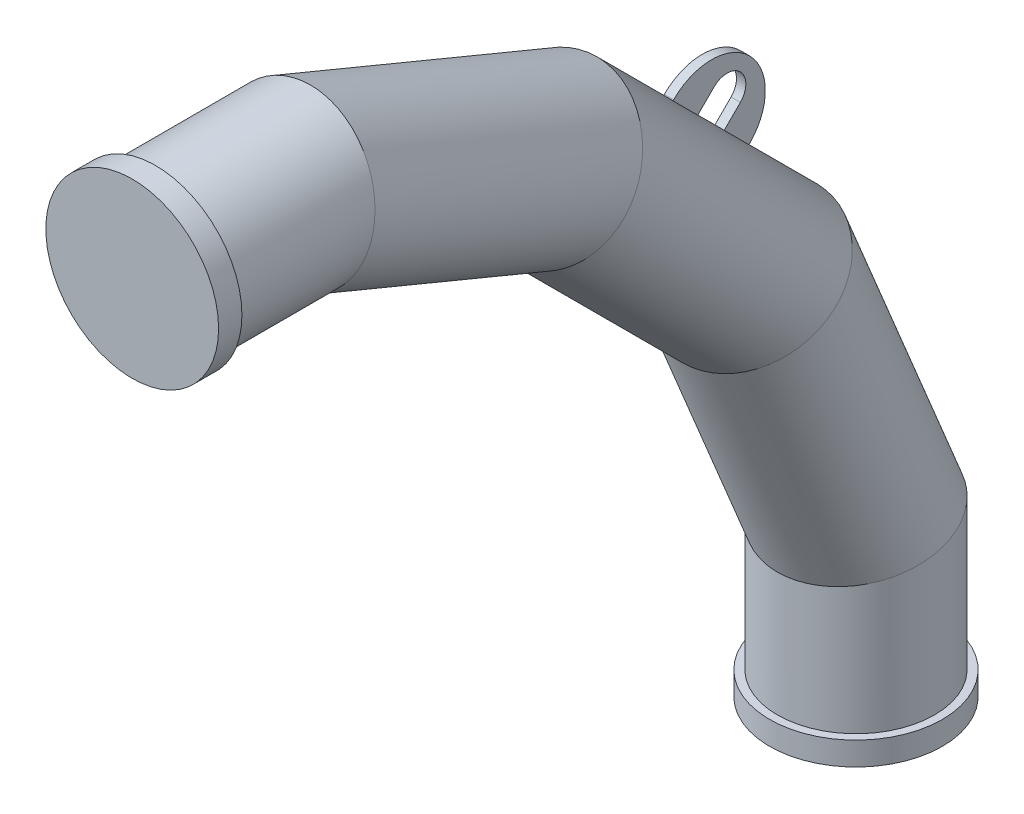
ISO-10303-21;
HEADER;
FILE_DESCRIPTION(('STEP AP214'),'2;1');
FILE_NAME('part.step','',(''),(''),'','','');
FILE_SCHEMA(('AUTOMOTIVE_DESIGN { 1 0 10303 214 1 1 1 1 }'));
ENDSEC;
DATA;
#1=APPLICATION_CONTEXT('core data for automotive mechanical design processes');
#2=APPLICATION_PROTOCOL_DEFINITION('international standard','automotive_design',2000,#1);
#3=PRODUCT_CONTEXT('',#1,'mechanical');
#4=PRODUCT('Part','Part','',(#3));
#5=PRODUCT_RELATED_PRODUCT_CATEGORY('part','',(#4));
#6=PRODUCT_DEFINITION_FORMATION('','',#4);
#7=PRODUCT_DEFINITION_CONTEXT('part definition',#1,'design');
#8=PRODUCT_DEFINITION('design','',#6,#7);
#9=PRODUCT_DEFINITION_SHAPE('','',#8);
#10=(LENGTH_UNIT() NAMED_UNIT(*) SI_UNIT(.MILLI.,.METRE.));
#11=(NAMED_UNIT(*) PLANE_ANGLE_UNIT() SI_UNIT($,.RADIAN.));
#12=(NAMED_UNIT(*) SI_UNIT($,.STERADIAN.) SOLID_ANGLE_UNIT());
#13=UNCERTAINTY_MEASURE_WITH_UNIT(LENGTH_MEASURE(1.E-05),#10,'distance_accuracy_value','');
#14=(GEOMETRIC_REPRESENTATION_CONTEXT(3) GLOBAL_UNCERTAINTY_ASSIGNED_CONTEXT((#13)) GLOBAL_UNIT_ASSIGNED_CONTEXT((#10,
#11,#12)) REPRESENTATION_CONTEXT('',''));
#15=CARTESIAN_POINT('',(0.,0.,0.));
#16=DIRECTION('',(0.,0.,1.));
#17=DIRECTION('',(1.,0.,0.));
#18=AXIS2_PLACEMENT_3D('',#15,#16,#17);
#19=CARTESIAN_POINT('',(0.,0.,-25.));
#20=DIRECTION('',(0.,0.,1.));
#21=DIRECTION('',(1.,0.,0.));
#22=AXIS2_PLACEMENT_3D('',#19,#20,#21);
#23=CYLINDRICAL_SURFACE('',#22,92.5);
#24=CARTESIAN_POINT('',(0.,0.,-25.));
#25=DIRECTION('',(0.,0.,1.));
#26=DIRECTION('',(1.,0.,0.));
#27=AXIS2_PLACEMENT_3D('',#24,#25,#26);
#28=CIRCLE('',#27,92.5);
#29=CARTESIAN_POINT('',(92.5,0.,-25.));
#30=VERTEX_POINT('',#29);
#31=EDGE_CURVE('E26',#30,#30,#28,.T.);
#32=ORIENTED_EDGE('',*,*,#31,.T.);
#33=EDGE_LOOP('',(#32));
#34=FACE_BOUND('',#33,.T.);
#35=CARTESIAN_POINT('',(0.,0.,0.));
#36=DIRECTION('',(0.,0.,1.));
#37=DIRECTION('',(1.,0.,0.));
#38=AXIS2_PLACEMENT_3D('',#35,#36,#37);
#39=CIRCLE('',#38,92.5);
#40=CARTESIAN_POINT('',(92.5,0.,0.));
#41=VERTEX_POINT('',#40);
#42=EDGE_CURVE('E19',#41,#41,#39,.T.);
#43=ORIENTED_EDGE('',*,*,#42,.F.);
#44=EDGE_LOOP('',(#43));
#45=FACE_BOUND('',#44,.T.);
#46=ADVANCED_FACE('F16',(#34,#45),#23,.T.);
#47=CARTESIAN_POINT('',(0.,0.,-25.));
#48=DIRECTION('',(0.,0.,1.));
#49=DIRECTION('',(1.,0.,0.));
#50=AXIS2_PLACEMENT_3D('',#47,#48,#49);
#51=PLANE('',#50);
#52=CARTESIAN_POINT('',(0.,-2.43121495121452E-13,-24.9999999999986));
#53=DIRECTION('',(0.,0.,-1.));
#54=DIRECTION('',(-1.,0.,0.));
#55=AXIS2_PLACEMENT_3D('',#52,#53,#54);
#56=CIRCLE('',#55,84.15);
#57=CARTESIAN_POINT('',(-84.1500000000003,-2.66477812002004E-13,-24.9999999999986));
#58=VERTEX_POINT('',#57);
#59=EDGE_CURVE('E10',#58,#58,#56,.T.);
#60=ORIENTED_EDGE('',*,*,#59,.F.);
#61=EDGE_LOOP('',(#60));
#62=FACE_BOUND('',#61,.T.);
#63=ORIENTED_EDGE('',*,*,#31,.F.);
#64=EDGE_LOOP('',(#63));
#65=FACE_BOUND('',#64,.T.);
#66=ADVANCED_FACE('F380',(#62,#65),#51,.F.);
#67=CARTESIAN_POINT('',(5.00000000000001,-142.948828351348,-632.051171648652));
#68=DIRECTION('',(1.,0.,0.));
#69=DIRECTION('',(0.,0.707106781186549,-0.707106781186548));
#70=AXIS2_PLACEMENT_3D('',#67,#68,#69);
#71=PLANE('',#70);
#72=DIRECTION('',(0.,0.707106781186548,-0.707106781186548));
#73=VECTOR('',#72,1.);
#74=CARTESIAN_POINT('',(5.00000000000001,-125.978265602871,-567.704454560676));
#75=LINE('',#74,#73);
#76=CARTESIAN_POINT('',(5.00000000000001,-119.613368083987,-574.06935207956));
#77=VERTEX_POINT('',#76);
#78=CARTESIAN_POINT('',(5.00000000000001,-118.907197791006,-574.775522372541));
#79=VERTEX_POINT('',#78);
#80=EDGE_CURVE('E311',#77,#79,#75,.T.);
#81=ORIENTED_EDGE('',*,*,#80,.F.);
#82=DIRECTION('',(0.,0.707106781186547,0.707106781186548));
#83=VECTOR('',#82,1.);
#84=CARTESIAN_POINT('',(5.00000000000001,-265.761220879233,-720.217204874807));
#85=LINE('',#84,#83);
#86=CARTESIAN_POINT('',(5.00000000000001,-146.129872378482,-600.585856374056));
#87=VERTEX_POINT('',#86);
#88=EDGE_CURVE('E51',#77,#87,#85,.F.);
#89=ORIENTED_EDGE('',*,*,#88,.T.);
#90=DIRECTION('',(0.,0.707106781186549,-0.707106781186549));
#91=VECTOR('',#90,1.);
#92=CARTESIAN_POINT('',(5.00000000000001,-145.423702085501,-601.292026667037));
#93=LINE('',#92,#91);
#94=CARTESIAN_POINT('',(5.00000000000001,-128.806692727617,-617.909036024921));
#95=VERTEX_POINT('',#94);
#96=EDGE_CURVE('E318',#87,#95,#93,.T.);
#97=ORIENTED_EDGE('',*,*,#96,.T.);
#98=CARTESIAN_POINT('',(5.00000000000001,-142.948828351348,-632.051171648652));
#99=DIRECTION('',(-1.,0.,0.));
#100=DIRECTION('',(0.,0.707106781186549,-0.707106781186548));
#101=AXIS2_PLACEMENT_3D('',#98,#99,#100);
#102=CIRCLE('',#101,20.);
#103=CARTESIAN_POINT('',(5.00000000000001,-157.090963975079,-646.193307272383));
#104=VERTEX_POINT('',#103);
#105=EDGE_CURVE('E321',#95,#104,#102,.T.);
#106=ORIENTED_EDGE('',*,*,#105,.T.);
#107=DIRECTION('',(0.,-0.707106781186549,0.707106781186548));
#108=VECTOR('',#107,1.);
#109=CARTESIAN_POINT('',(5.00000000000001,-173.707973332963,-629.576297914499));
#110=LINE('',#109,#108);
#111=CARTESIAN_POINT('',(5.00000000000001,-174.414143625944,-628.870127621518));
#112=VERTEX_POINT('',#111);
#113=EDGE_CURVE('E325',#104,#112,#110,.T.);
#114=ORIENTED_EDGE('',*,*,#113,.T.);
#115=CARTESIAN_POINT('',(5.00000000000001,-200.93064792044,-655.386631916014));
#116=VERTEX_POINT('',#115);
#117=EDGE_CURVE('E290',#112,#116,#85,.F.);
#118=ORIENTED_EDGE('',*,*,#117,.T.);
#119=DIRECTION('',(0.,0.707106781186548,-0.707106781186548));
#120=VECTOR('',#119,1.);
#121=CARTESIAN_POINT('',(5.00000000000001,-207.295545439325,-649.021734397129));
#122=LINE('',#121,#120);
#123=CARTESIAN_POINT('',(5.00000000000001,-200.224477627459,-656.092802208994));
#124=VERTEX_POINT('',#123);
#125=EDGE_CURVE('E305',#116,#124,#122,.T.);
#126=ORIENTED_EDGE('',*,*,#125,.T.);
#127=CARTESIAN_POINT('',(5.00000000000001,-159.565837709232,-615.434162290768));
#128=DIRECTION('',(1.,0.,0.));
#129=DIRECTION('',(0.,0.707106781186549,-0.707106781186548));
#130=AXIS2_PLACEMENT_3D('',#127,#128,#129);
#131=CIRCLE('',#130,57.5);
#132=EDGE_CURVE('E328',#124,#79,#131,.T.);
#133=ORIENTED_EDGE('',*,*,#132,.T.);
#134=EDGE_LOOP('',(#81,#89,#97,#106,#114,#118,#126,#133));
#135=FACE_BOUND('',#134,.T.);
#136=ADVANCED_FACE('F385',(#135),#71,.T.);
#137=CARTESIAN_POINT('',(-5.,-142.948828351348,-632.051171648652));
#138=DIRECTION('',(1.,0.,0.));
#139=DIRECTION('',(0.,0.707106781186549,-0.707106781186548));
#140=AXIS2_PLACEMENT_3D('',#137,#138,#139);
#141=PLANE('',#140);
#142=DIRECTION('',(0.,0.707106781186547,0.707106781186548));
#143=VECTOR('',#142,1.);
#144=CARTESIAN_POINT('',(-5.,-265.761220879233,-720.217204874807));
#145=LINE('',#144,#143);
#146=CARTESIAN_POINT('',(-5.,-119.613368083987,-574.06935207956));
#147=VERTEX_POINT('',#146);
#148=CARTESIAN_POINT('',(-4.99999999999999,-146.129872378482,-600.585856374056));
#149=VERTEX_POINT('',#148);
#150=EDGE_CURVE('E291',#147,#149,#145,.F.);
#151=ORIENTED_EDGE('',*,*,#150,.F.);
#152=DIRECTION('',(0.,0.707106781186548,-0.707106781186548));
#153=VECTOR('',#152,1.);
#154=CARTESIAN_POINT('',(-5.,-125.978265602871,-567.704454560676));
#155=LINE('',#154,#153);
#156=CARTESIAN_POINT('',(-5.,-118.907197791006,-574.775522372541));
#157=VERTEX_POINT('',#156);
#158=EDGE_CURVE('E314',#147,#157,#155,.T.);
#159=ORIENTED_EDGE('',*,*,#158,.T.);
#160=CARTESIAN_POINT('',(-5.,-159.565837709232,-615.434162290768));
#161=DIRECTION('',(1.,0.,0.));
#162=DIRECTION('',(0.,0.707106781186549,-0.707106781186548));
#163=AXIS2_PLACEMENT_3D('',#160,#161,#162);
#164=CIRCLE('',#163,57.5);
#165=CARTESIAN_POINT('',(-5.,-200.224477627459,-656.092802208994));
#166=VERTEX_POINT('',#165);
#167=EDGE_CURVE('E322',#166,#157,#164,.T.);
#168=ORIENTED_EDGE('',*,*,#167,.F.);
#169=DIRECTION('',(0.,0.707106781186548,-0.707106781186548));
#170=VECTOR('',#169,1.);
#171=CARTESIAN_POINT('',(-5.,-207.295545439325,-649.021734397129));
#172=LINE('',#171,#170);
#173=CARTESIAN_POINT('',(-5.,-200.93064792044,-655.386631916014));
#174=VERTEX_POINT('',#173);
#175=EDGE_CURVE('E308',#174,#166,#172,.T.);
#176=ORIENTED_EDGE('',*,*,#175,.F.);
#177=CARTESIAN_POINT('',(-4.99999999999999,-174.414143625944,-628.870127621518));
#178=VERTEX_POINT('',#177);
#179=EDGE_CURVE('E275',#178,#174,#145,.F.);
#180=ORIENTED_EDGE('',*,*,#179,.F.);
#181=DIRECTION('',(0.,-0.707106781186549,0.707106781186548));
#182=VECTOR('',#181,1.);
#183=CARTESIAN_POINT('',(-5.,-173.707973332963,-629.576297914499));
#184=LINE('',#183,#182);
#185=CARTESIAN_POINT('',(-5.,-157.090963975079,-646.193307272383));
#186=VERTEX_POINT('',#185);
#187=EDGE_CURVE('E338',#186,#178,#184,.T.);
#188=ORIENTED_EDGE('',*,*,#187,.F.);
#189=CARTESIAN_POINT('',(-5.,-142.948828351348,-632.051171648652));
#190=DIRECTION('',(-1.,0.,0.));
#191=DIRECTION('',(0.,0.707106781186549,-0.707106781186548));
#192=AXIS2_PLACEMENT_3D('',#189,#190,#191);
#193=CIRCLE('',#192,20.);
#194=CARTESIAN_POINT('',(-5.,-128.806692727617,-617.909036024921));
#195=VERTEX_POINT('',#194);
#196=EDGE_CURVE('E335',#195,#186,#193,.T.);
#197=ORIENTED_EDGE('',*,*,#196,.F.);
#198=DIRECTION('',(0.,0.707106781186549,-0.707106781186549));
#199=VECTOR('',#198,1.);
#200=CARTESIAN_POINT('',(-5.,-145.423702085501,-601.292026667037));
#201=LINE('',#200,#199);
#202=EDGE_CURVE('E317',#149,#195,#201,.T.);
#203=ORIENTED_EDGE('',*,*,#202,.F.);
#204=EDGE_LOOP('',(#151,#159,#168,#176,#180,#188,#197,#203));
#205=FACE_BOUND('',#204,.T.);
#206=ADVANCED_FACE('F391',(#205),#141,.F.);
#207=CARTESIAN_POINT('',(5.00000000000001,-145.423702085501,-601.292026667037));
#208=DIRECTION('',(0.,0.707106781186549,0.707106781186549));
#209=DIRECTION('',(0.,-0.707106781186549,0.707106781186549));
#210=AXIS2_PLACEMENT_3D('',#207,#208,#209);
#211=PLANE('',#210);
#212=CARTESIAN_POINT('',(0.,-205.527778486358,-541.18795026618));
#213=DIRECTION('',(0.,0.707106781186549,0.707106781186549));
#214=DIRECTION('',(0.,-0.707106781186548,0.707106781186547));
#215=AXIS2_PLACEMENT_3D('',#212,#213,#214);
#216=CIRCLE('',#215,84.15);
#217=EDGE_CURVE('E301',#149,#87,#216,.F.);
#218=ORIENTED_EDGE('',*,*,#217,.F.);
#219=ORIENTED_EDGE('',*,*,#202,.T.);
#220=DIRECTION('',(-1.,0.,0.));
#221=VECTOR('',#220,1.);
#222=CARTESIAN_POINT('',(5.00000000000001,-128.806692727617,-617.909036024921));
#223=LINE('',#222,#221);
#224=EDGE_CURVE('E355',#95,#195,#223,.T.);
#225=ORIENTED_EDGE('',*,*,#224,.F.);
#226=ORIENTED_EDGE('',*,*,#96,.F.);
#227=EDGE_LOOP('',(#218,#219,#225,#226));
#228=FACE_BOUND('',#227,.T.);
#229=ADVANCED_FACE('F396',(#228),#211,.F.);
#230=CARTESIAN_POINT('',(5.00000000000001,-142.948828351348,-632.051171648652));
#231=DIRECTION('',(-1.,0.,0.));
#232=DIRECTION('',(0.,-0.707106781186549,0.707106781186548));
#233=AXIS2_PLACEMENT_3D('',#230,#231,#232);
#234=CYLINDRICAL_SURFACE('',#233,20.);
#235=ORIENTED_EDGE('',*,*,#196,.T.);
#236=DIRECTION('',(-1.,0.,0.));
#237=VECTOR('',#236,1.);
#238=CARTESIAN_POINT('',(5.00000000000001,-157.090963975079,-646.193307272383));
#239=LINE('',#238,#237);
#240=EDGE_CURVE('E351',#104,#186,#239,.T.);
#241=ORIENTED_EDGE('',*,*,#240,.F.);
#242=ORIENTED_EDGE('',*,*,#105,.F.);
#243=ORIENTED_EDGE('',*,*,#224,.T.);
#244=EDGE_LOOP('',(#235,#241,#242,#243));
#245=FACE_BOUND('',#244,.T.);
#246=ADVANCED_FACE('F458',(#245),#234,.F.);
#247=CARTESIAN_POINT('',(5.00000000000001,-173.707973332963,-629.576297914499));
#248=DIRECTION('',(0.,-0.707106781186548,-0.707106781186549));
#249=DIRECTION('',(0.,0.707106781186549,-0.707106781186548));
#250=AXIS2_PLACEMENT_3D('',#247,#248,#249);
#251=PLANE('',#250);
#252=CARTESIAN_POINT('',(0.,-233.81204973382,-569.472221513642));
#253=DIRECTION('',(0.,-0.707106781186548,-0.707106781186549));
#254=DIRECTION('',(0.,0.707106781186548,-0.707106781186547));
#255=AXIS2_PLACEMENT_3D('',#252,#253,#254);
#256=CIRCLE('',#255,84.15);
#257=EDGE_CURVE('E39',#112,#178,#256,.F.);
#258=ORIENTED_EDGE('',*,*,#257,.F.);
#259=ORIENTED_EDGE('',*,*,#113,.F.);
#260=ORIENTED_EDGE('',*,*,#240,.T.);
#261=ORIENTED_EDGE('',*,*,#187,.T.);
#262=EDGE_LOOP('',(#258,#259,#260,#261));
#263=FACE_BOUND('',#262,.T.);
#264=ADVANCED_FACE('F455',(#263),#251,.F.);
#265=CARTESIAN_POINT('',(5.00000000000001,-159.565837709232,-615.434162290768));
#266=DIRECTION('',(-1.,0.,0.));
#267=DIRECTION('',(0.,-0.707106781186549,0.707106781186548));
#268=AXIS2_PLACEMENT_3D('',#265,#266,#267);
#269=CYLINDRICAL_SURFACE('',#268,57.5);
#270=ORIENTED_EDGE('',*,*,#167,.T.);
#271=DIRECTION('',(-1.,0.,0.));
#272=VECTOR('',#271,1.);
#273=CARTESIAN_POINT('',(5.00000000000001,-118.907197791006,-574.775522372541));
#274=LINE('',#273,#272);
#275=EDGE_CURVE('E332',#79,#157,#274,.T.);
#276=ORIENTED_EDGE('',*,*,#275,.F.);
#277=ORIENTED_EDGE('',*,*,#132,.F.);
#278=DIRECTION('',(-1.,0.,0.));
#279=VECTOR('',#278,1.);
#280=CARTESIAN_POINT('',(5.00000000000001,-200.224477627459,-656.092802208994));
#281=LINE('',#280,#279);
#282=EDGE_CURVE('E347',#124,#166,#281,.T.);
#283=ORIENTED_EDGE('',*,*,#282,.T.);
#284=EDGE_LOOP('',(#270,#276,#277,#283));
#285=FACE_BOUND('',#284,.T.);
#286=ADVANCED_FACE('F447',(#285),#269,.T.);
#287=CARTESIAN_POINT('',(5.00000000000001,-125.978265602871,-567.704454560676));
#288=DIRECTION('',(0.,-0.707106781186548,-0.707106781186548));
#289=DIRECTION('',(0.,0.707106781186548,-0.707106781186548));
#290=AXIS2_PLACEMENT_3D('',#287,#288,#289);
#291=PLANE('',#290);
#292=CARTESIAN_POINT('',(0.,-179.011274191862,-514.671445971685));
#293=DIRECTION('',(0.,-0.707106781186548,-0.707106781186548));
#294=DIRECTION('',(0.,0.707106781186548,-0.707106781186548));
#295=AXIS2_PLACEMENT_3D('',#292,#293,#294);
#296=CIRCLE('',#295,84.15);
#297=EDGE_CURVE('E297',#77,#147,#296,.F.);
#298=ORIENTED_EDGE('',*,*,#297,.F.);
#299=ORIENTED_EDGE('',*,*,#80,.T.);
#300=ORIENTED_EDGE('',*,*,#275,.T.);
#301=ORIENTED_EDGE('',*,*,#158,.F.);
#302=EDGE_LOOP('',(#298,#299,#300,#301));
#303=FACE_BOUND('',#302,.T.);
#304=ADVANCED_FACE('F444',(#303),#291,.F.);
#305=CARTESIAN_POINT('',(-5.,-207.295545439325,-649.021734397129));
#306=DIRECTION('',(0.,0.707106781186548,0.707106781186548));
#307=DIRECTION('',(0.,-0.707106781186548,0.707106781186548));
#308=AXIS2_PLACEMENT_3D('',#305,#306,#307);
#309=PLANE('',#308);
#310=CARTESIAN_POINT('',(0.,-260.328554028315,-595.988725808138));
#311=DIRECTION('',(0.,0.707106781186548,0.707106781186548));
#312=DIRECTION('',(0.,-0.707106781186548,0.707106781186548));
#313=AXIS2_PLACEMENT_3D('',#310,#311,#312);
#314=CIRCLE('',#313,84.15);
#315=EDGE_CURVE('E359',#174,#116,#314,.F.);
#316=ORIENTED_EDGE('',*,*,#315,.F.);
#317=ORIENTED_EDGE('',*,*,#175,.T.);
#318=ORIENTED_EDGE('',*,*,#282,.F.);
#319=ORIENTED_EDGE('',*,*,#125,.F.);
#320=EDGE_LOOP('',(#316,#317,#318,#319));
#321=FACE_BOUND('',#320,.T.);
#322=ADVANCED_FACE('F422',(#321),#309,.F.);
#323=CARTESIAN_POINT('',(0.,-325.159126987108,-660.819298766931));
#324=DIRECTION('',(0.,0.707106781186547,0.707106781186548));
#325=DIRECTION('',(0.,-0.707106781186548,0.707106781186547));
#326=AXIS2_PLACEMENT_3D('',#323,#324,#325);
#327=CYLINDRICAL_SURFACE('',#326,84.15);
#328=CARTESIAN_POINT('',(0.,-325.159126987117,-660.819298766924));
#329=DIRECTION('',(0.,0.831469612302548,0.555570233019599));
#330=DIRECTION('',(0.,-0.555570233019599,0.831469612302548));
#331=AXIS2_PLACEMENT_3D('',#328,#329,#330);
#332=ELLIPSE('',#331,85.79859596323,84.15);
#333=CARTESIAN_POINT('',(0.,-372.826272939163,-589.480373445274));
#334=VERTEX_POINT('',#333);
#335=EDGE_CURVE('E266',#334,#334,#332,.T.);
#336=ORIENTED_EDGE('',*,*,#335,.T.);
#337=EDGE_LOOP('',(#336));
#338=FACE_BOUND('',#337,.T.);
#339=CARTESIAN_POINT('',(0.,-114.180701233069,-449.840873012892));
#340=DIRECTION('',(0.,0.555570233019602,0.831469612302545));
#341=DIRECTION('',(0.,0.831469612302545,-0.555570233019602));
#342=AXIS2_PLACEMENT_3D('',#339,#340,#341);
#343=ELLIPSE('',#342,85.79859596323,84.15);
#344=CARTESIAN_POINT('',(0.,-42.8417759114195,-497.508018964938));
#345=VERTEX_POINT('',#344);
#346=EDGE_CURVE('E262',#345,#345,#343,.T.);
#347=ORIENTED_EDGE('',*,*,#346,.F.);
#348=EDGE_LOOP('',(#347));
#349=FACE_BOUND('',#348,.T.);
#350=ORIENTED_EDGE('',*,*,#117,.F.);
#351=ORIENTED_EDGE('',*,*,#257,.T.);
#352=ORIENTED_EDGE('',*,*,#179,.T.);
#353=ORIENTED_EDGE('',*,*,#315,.T.);
#354=EDGE_LOOP('',(#350,#351,#352,#353));
#355=FACE_BOUND('',#354,.T.);
#356=ORIENTED_EDGE('',*,*,#150,.T.);
#357=ORIENTED_EDGE('',*,*,#217,.T.);
#358=ORIENTED_EDGE('',*,*,#88,.F.);
#359=ORIENTED_EDGE('',*,*,#297,.T.);
#360=EDGE_LOOP('',(#356,#357,#358,#359));
#361=FACE_BOUND('',#360,.T.);
#362=ADVANCED_FACE('F418',(#338,#349,#355,#361),#327,.T.);
#363=CARTESIAN_POINT('',(0.,-775.000000000008,-774.999999999992));
#364=DIRECTION('',(0.,-1.,0.));
#365=DIRECTION('',(1.,0.,0.));
#366=AXIS2_PLACEMENT_3D('',#363,#364,#365);
#367=PLANE('',#366);
#368=CARTESIAN_POINT('',(0.,-775.000000000008,-774.999999999992));
#369=DIRECTION('',(0.,-1.,0.));
#370=DIRECTION('',(1.,0.,0.));
#371=AXIS2_PLACEMENT_3D('',#368,#369,#370);
#372=CIRCLE('',#371,92.5);
#373=CARTESIAN_POINT('',(92.5,-775.000000000008,-774.999999999992));
#374=VERTEX_POINT('',#373);
#375=EDGE_CURVE('E280',#374,#374,#372,.T.);
#376=ORIENTED_EDGE('',*,*,#375,.T.);
#377=EDGE_LOOP('',(#376));
#378=FACE_BOUND('',#377,.T.);
#379=ADVANCED_FACE('F421',(#378),#367,.T.);
#380=CARTESIAN_POINT('',(0.,-750.000000000008,-774.999999999992));
#381=DIRECTION('',(0.,-1.,0.));
#382=DIRECTION('',(1.,0.,0.));
#383=AXIS2_PLACEMENT_3D('',#380,#381,#382);
#384=CYLINDRICAL_SURFACE('',#383,92.5);
#385=CARTESIAN_POINT('',(0.,-750.000000000008,-774.999999999992));
#386=DIRECTION('',(0.,-1.,0.));
#387=DIRECTION('',(1.,0.,0.));
#388=AXIS2_PLACEMENT_3D('',#385,#386,#387);
#389=CIRCLE('',#388,92.5);
#390=CARTESIAN_POINT('',(92.5,-750.000000000008,-774.999999999992));
#391=VERTEX_POINT('',#390);
#392=EDGE_CURVE('E276',#391,#391,#389,.T.);
#393=ORIENTED_EDGE('',*,*,#392,.T.);
#394=EDGE_LOOP('',(#393));
#395=FACE_BOUND('',#394,.T.);
#396=ORIENTED_EDGE('',*,*,#375,.F.);
#397=EDGE_LOOP('',(#396));
#398=FACE_BOUND('',#397,.T.);
#399=ADVANCED_FACE('F434',(#395,#398),#384,.T.);
#400=CARTESIAN_POINT('',(0.,-750.000000000008,-774.999999999992));
#401=DIRECTION('',(0.,-1.,0.));
#402=DIRECTION('',(1.,0.,0.));
#403=AXIS2_PLACEMENT_3D('',#400,#401,#402);
#404=PLANE('',#403);
#405=CARTESIAN_POINT('',(0.,-750.000000000008,-774.999999999992));
#406=DIRECTION('',(0.,1.,0.));
#407=DIRECTION('',(1.,0.,0.));
#408=AXIS2_PLACEMENT_3D('',#405,#406,#407);
#409=CIRCLE('',#408,84.15);
#410=CARTESIAN_POINT('',(84.1500000000002,-750.000000000008,-774.999999999992));
#411=VERTEX_POINT('',#410);
#412=EDGE_CURVE('E271',#411,#411,#409,.T.);
#413=ORIENTED_EDGE('',*,*,#412,.F.);
#414=EDGE_LOOP('',(#413));
#415=FACE_BOUND('',#414,.T.);
#416=ORIENTED_EDGE('',*,*,#392,.F.);
#417=EDGE_LOOP('',(#416));
#418=FACE_BOUND('',#417,.T.);
#419=ADVANCED_FACE('F430',(#415,#418),#404,.F.);
#420=CARTESIAN_POINT('',(0.,-600.815724465265,-774.999999999993));
#421=DIRECTION('',(0.,-1.,0.));
#422=DIRECTION('',(-1.,0.,0.));
#423=AXIS2_PLACEMENT_3D('',#420,#421,#422);
#424=CYLINDRICAL_SURFACE('',#423,84.15);
#425=ORIENTED_EDGE('',*,*,#412,.T.);
#426=EDGE_LOOP('',(#425));
#427=FACE_BOUND('',#426,.T.);
#428=CARTESIAN_POINT('',(0.,-600.815724465265,-774.999999999993));
#429=DIRECTION('',(0.,0.980785280403231,0.195090322016124));
#430=DIRECTION('',(0.,-0.195090322016124,0.980785280403231));
#431=AXIS2_PLACEMENT_3D('',#428,#429,#430);
#432=ELLIPSE('',#431,85.79859596323,84.15);
#433=CARTESIAN_POINT('',(0.,-617.554200180263,-690.849999999993));
#434=VERTEX_POINT('',#433);
#435=EDGE_CURVE('E270',#434,#434,#432,.T.);
#436=ORIENTED_EDGE('',*,*,#435,.F.);
#437=EDGE_LOOP('',(#436));
#438=FACE_BOUND('',#437,.T.);
#439=ADVANCED_FACE('F426',(#427,#438),#424,.T.);
#440=CARTESIAN_POINT('',(0.,-325.159126987117,-660.819298766924));
#441=DIRECTION('',(0.,-0.923879532511289,-0.382683432365085));
#442=DIRECTION('',(0.,-0.382683432365085,0.923879532511289));
#443=AXIS2_PLACEMENT_3D('',#440,#441,#442);
#444=CYLINDRICAL_SURFACE('',#443,84.15);
#445=ORIENTED_EDGE('',*,*,#335,.F.);
#446=EDGE_LOOP('',(#445));
#447=FACE_BOUND('',#446,.T.);
#448=ORIENTED_EDGE('',*,*,#435,.T.);
#449=EDGE_LOOP('',(#448));
#450=FACE_BOUND('',#449,.T.);
#451=ADVANCED_FACE('F410',(#447,#450),#444,.T.);
#452=CARTESIAN_POINT('',(-1.13548594005076E-13,-114.18070123307,-449.84087301289));
#453=DIRECTION('',(0.,0.382683432365089,0.923879532511287));
#454=DIRECTION('',(0.,-0.923879532511287,0.382683432365089));
#455=AXIS2_PLACEMENT_3D('',#452,#453,#454);
#456=CYLINDRICAL_SURFACE('',#455,84.15);
#457=ORIENTED_EDGE('',*,*,#346,.T.);
#458=EDGE_LOOP('',(#457));
#459=FACE_BOUND('',#458,.T.);
#460=CARTESIAN_POINT('',(0.,-2.56999282929266E-13,-174.184275534741));
#461=DIRECTION('',(0.,0.195090322016128,0.98078528040323));
#462=DIRECTION('',(0.,0.980785280403231,-0.195090322016128));
#463=AXIS2_PLACEMENT_3D('',#460,#461,#462);
#464=ELLIPSE('',#463,85.79859596323,84.15);
#465=CARTESIAN_POINT('',(0.,84.1499999999997,-190.92275124974));
#466=VERTEX_POINT('',#465);
#467=EDGE_CURVE('E255',#466,#466,#464,.T.);
#468=ORIENTED_EDGE('',*,*,#467,.F.);
#469=EDGE_LOOP('',(#468));
#470=FACE_BOUND('',#469,.T.);
#471=ADVANCED_FACE('F404',(#459,#470),#456,.T.);
#472=CARTESIAN_POINT('',(0.,-2.43121495121452E-13,-174.184275534741));
#473=DIRECTION('',(0.,0.,1.));
#474=DIRECTION('',(1.,0.,0.));
#475=AXIS2_PLACEMENT_3D('',#472,#473,#474);
#476=CYLINDRICAL_SURFACE('',#475,84.15);
#477=ORIENTED_EDGE('',*,*,#59,.T.);
#478=EDGE_LOOP('',(#477));
#479=FACE_BOUND('',#478,.T.);
#480=ORIENTED_EDGE('',*,*,#467,.T.);
#481=EDGE_LOOP('',(#480));
#482=FACE_BOUND('',#481,.T.);
#483=ADVANCED_FACE('F399',(#479,#482),#476,.T.);
#484=CARTESIAN_POINT('',(0.,0.,0.));
#485=DIRECTION('',(0.,0.,1.));
#486=DIRECTION('',(1.,0.,0.));
#487=AXIS2_PLACEMENT_3D('',#484,#485,#486);
#488=PLANE('',#487);
#489=ORIENTED_EDGE('',*,*,#42,.T.);
#490=EDGE_LOOP('',(#489));
#491=FACE_BOUND('',#490,.T.);
#492=ADVANCED_FACE('F377',(#491),#488,.T.);
#493=CLOSED_SHELL('',(#46,#66,#136,#206,#229,#246,#264,#286,#304,#322,#362,#379,#399,#419,#439,
#451,#471,#483,#492));
#494=CARTESIAN_POINT('',(0.,-750.000000000008,-774.999999999992));
#495=DIRECTION('',(0.,-1.,0.));
#496=DIRECTION('',(0.,0.,-1.));
#497=AXIS2_PLACEMENT_3D('',#494,#495,#496);
#498=PLANE('',#497);
#499=CARTESIAN_POINT('',(0.,-750.000000000008,-774.999999999992));
#500=DIRECTION('',(0.,1.,0.));
#501=DIRECTION('',(0.,0.,-1.));
#502=AXIS2_PLACEMENT_3D('',#499,#500,#501);
#503=CIRCLE('',#502,35.);
#504=CARTESIAN_POINT('',(0.,-750.000000000008,-809.999999999992));
#505=VERTEX_POINT('',#504);
#506=EDGE_CURVE('E250',#505,#505,#503,.T.);
#507=ORIENTED_EDGE('',*,*,#506,.T.);
#508=EDGE_LOOP('',(#507));
#509=FACE_BOUND('',#508,.T.);
#510=ADVANCED_FACE('F684',(#509),#498,.F.);
#511=CARTESIAN_POINT('',(0.,0.,-25.));
#512=DIRECTION('',(0.,0.,1.));
#513=DIRECTION('',(1.,0.,0.));
#514=AXIS2_PLACEMENT_3D('',#511,#512,#513);
#515=PLANE('',#514);
#516=CARTESIAN_POINT('',(0.,-5.55111512312578E-12,-24.9999999999925));
#517=DIRECTION('',(0.,0.,1.));
#518=DIRECTION('',(1.,0.,0.));
#519=AXIS2_PLACEMENT_3D('',#516,#517,#518);
#520=CIRCLE('',#519,35.);
#521=CARTESIAN_POINT('',(0.,34.9999999999945,-24.9999999999925));
#522=VERTEX_POINT('',#521);
#523=EDGE_CURVE('E251',#522,#522,#520,.F.);
#524=ORIENTED_EDGE('',*,*,#523,.T.);
#525=EDGE_LOOP('',(#524));
#526=FACE_BOUND('',#525,.T.);
#527=ADVANCED_FACE('F687',(#526),#515,.F.);
#528=CARTESIAN_POINT('',(0.,-750.000000000006,-24.9999999999925));
#529=DIRECTION('',(1.,0.,0.));
#530=DIRECTION('',(0.,-1.,0.));
#531=AXIS2_PLACEMENT_3D('',#528,#529,#530);
#532=TOROIDAL_SURFACE('',#531,750.,35.);
#533=CARTESIAN_POINT('',(0.,-750.000000000006,-24.9999999999925));
#534=DIRECTION('',(1.,0.,0.));
#535=DIRECTION('',(0.,-1.,0.));
#536=AXIS2_PLACEMENT_3D('',#533,#534,#535);
#537=CIRCLE('',#536,785.);
#538=EDGE_CURVE('',#505,#522,#537,.T.);
#539=ORIENTED_EDGE('',*,*,#506,.F.);
#540=ORIENTED_EDGE('',*,*,#523,.F.);
#541=ORIENTED_EDGE('',*,*,#538,.T.);
#542=ORIENTED_EDGE('',*,*,#538,.F.);
#543=EDGE_LOOP('',(#539,#541,#540,#542));
#544=FACE_BOUND('',#543,.T.);
#545=ADVANCED_FACE('F415',(#544),#532,.F.);
#546=CLOSED_SHELL('',(#510,#527,#545));
#547=CARTESIAN_POINT('',(27.7445488464695,66.9812661070681,-20.));
#548=DIRECTION('',(0.,0.,1.));
#549=DIRECTION('',(1.,0.,0.));
#550=AXIS2_PLACEMENT_3D('',#547,#548,#549);
#551=PLANE('',#550);
#552=CARTESIAN_POINT('',(27.7445488464695,66.9812661070681,-20.));
#553=DIRECTION('',(0.,0.,1.));
#554=DIRECTION('',(1.,0.,0.));
#555=AXIS2_PLACEMENT_3D('',#552,#553,#554);
#556=CIRCLE('',#555,7.);
#557=CARTESIAN_POINT('',(34.7445488464695,66.9812661070681,-20.));
#558=VERTEX_POINT('',#557);
#559=EDGE_CURVE('E219',#558,#558,#556,.T.);
#560=ORIENTED_EDGE('',*,*,#559,.F.);
#561=EDGE_LOOP('',(#560));
#562=FACE_BOUND('',#561,.T.);
#563=ADVANCED_FACE('F888',(#562),#551,.F.);
#564=CARTESIAN_POINT('',(27.7445488464695,66.9812661070681,-20.));
#565=DIRECTION('',(0.,0.,1.));
#566=DIRECTION('',(1.,0.,0.));
#567=AXIS2_PLACEMENT_3D('',#564,#565,#566);
#568=CONICAL_SURFACE('',#567,7.,1.02974425867665);
#569=CARTESIAN_POINT('',(27.7445488464695,66.9812661070681,-24.206024333193));
#570=VERTEX_POINT('',#569);
#571=VERTEX_LOOP('',#570);
#572=FACE_BOUND('',#571,.T.);
#573=ORIENTED_EDGE('',*,*,#559,.T.);
#574=EDGE_LOOP('',(#573));
#575=FACE_BOUND('',#574,.T.);
#576=ADVANCED_FACE('F894',(#572,#575),#568,.F.);
#577=CLOSED_SHELL('',(#563,#576));
#578=CARTESIAN_POINT('',(66.9812661070685,27.7445488464684,-20.));
#579=DIRECTION('',(0.,0.,1.));
#580=DIRECTION('',(1.,0.,0.));
#581=AXIS2_PLACEMENT_3D('',#578,#579,#580);
#582=PLANE('',#581);
#583=CARTESIAN_POINT('',(66.9812661070685,27.7445488464684,-20.));
#584=DIRECTION('',(0.,0.,1.));
#585=DIRECTION('',(1.,0.,0.));
#586=AXIS2_PLACEMENT_3D('',#583,#584,#585);
#587=CIRCLE('',#586,6.99999999999999);
#588=CARTESIAN_POINT('',(73.9812661070685,27.7445488464684,-20.));
#589=VERTEX_POINT('',#588);
#590=EDGE_CURVE('E224',#589,#589,#587,.T.);
#591=ORIENTED_EDGE('',*,*,#590,.F.);
#592=EDGE_LOOP('',(#591));
#593=FACE_BOUND('',#592,.T.);
#594=ADVANCED_FACE('F912',(#593),#582,.F.);
#595=CARTESIAN_POINT('',(66.9812661070685,27.7445488464684,-20.));
#596=DIRECTION('',(0.,0.,1.));
#597=DIRECTION('',(1.,0.,0.));
#598=AXIS2_PLACEMENT_3D('',#595,#596,#597);
#599=CONICAL_SURFACE('',#598,6.99999999999999,1.02974425867665);
#600=CARTESIAN_POINT('',(66.9812661070685,27.7445488464684,-24.2060243331929));
#601=VERTEX_POINT('',#600);
#602=VERTEX_LOOP('',#601);
#603=FACE_BOUND('',#602,.T.);
#604=ORIENTED_EDGE('',*,*,#590,.T.);
#605=EDGE_LOOP('',(#604));
#606=FACE_BOUND('',#605,.T.);
#607=ADVANCED_FACE('F917',(#603,#606),#599,.F.);
#608=CLOSED_SHELL('',(#594,#607));
#609=CARTESIAN_POINT('',(66.9812661070679,-27.7445488464697,-20.));
#610=DIRECTION('',(0.,0.,1.));
#611=DIRECTION('',(1.,0.,0.));
#612=AXIS2_PLACEMENT_3D('',#609,#610,#611);
#613=PLANE('',#612);
#614=CARTESIAN_POINT('',(66.9812661070679,-27.7445488464697,-20.));
#615=DIRECTION('',(0.,0.,1.));
#616=DIRECTION('',(1.,0.,0.));
#617=AXIS2_PLACEMENT_3D('',#614,#615,#616);
#618=CIRCLE('',#617,6.99999999999999);
#619=CARTESIAN_POINT('',(73.9812661070679,-27.7445488464697,-20.));
#620=VERTEX_POINT('',#619);
#621=EDGE_CURVE('E228',#620,#620,#618,.T.);
#622=ORIENTED_EDGE('',*,*,#621,.F.);
#623=EDGE_LOOP('',(#622));
#624=FACE_BOUND('',#623,.T.);
#625=ADVANCED_FACE('F792',(#624),#613,.F.);
#626=CARTESIAN_POINT('',(66.9812661070679,-27.7445488464697,-20.));
#627=DIRECTION('',(0.,0.,1.));
#628=DIRECTION('',(1.,0.,0.));
#629=AXIS2_PLACEMENT_3D('',#626,#627,#628);
#630=CONICAL_SURFACE('',#629,6.99999999999999,1.02974425867665);
#631=CARTESIAN_POINT('',(66.9812661070679,-27.7445488464697,-24.206024333193));
#632=VERTEX_POINT('',#631);
#633=VERTEX_LOOP('',#632);
#634=FACE_BOUND('',#633,.T.);
#635=ORIENTED_EDGE('',*,*,#621,.T.);
#636=EDGE_LOOP('',(#635));
#637=FACE_BOUND('',#636,.T.);
#638=ADVANCED_FACE('F813',(#634,#637),#630,.F.);
#639=CLOSED_SHELL('',(#625,#638));
#640=CARTESIAN_POINT('',(27.7445488464686,-66.9812661070684,-20.));
#641=DIRECTION('',(0.,0.,1.));
#642=DIRECTION('',(1.,0.,0.));
#643=AXIS2_PLACEMENT_3D('',#640,#641,#642);
#644=PLANE('',#643);
#645=CARTESIAN_POINT('',(27.7445488464686,-66.9812661070684,-20.));
#646=DIRECTION('',(0.,0.,1.));
#647=DIRECTION('',(1.,0.,0.));
#648=AXIS2_PLACEMENT_3D('',#645,#646,#647);
#649=CIRCLE('',#648,6.99999999999999);
#650=CARTESIAN_POINT('',(34.7445488464686,-66.9812661070684,-20.));
#651=VERTEX_POINT('',#650);
#652=EDGE_CURVE('E232',#651,#651,#649,.T.);
#653=ORIENTED_EDGE('',*,*,#652,.F.);
#654=EDGE_LOOP('',(#653));
#655=FACE_BOUND('',#654,.T.);
#656=ADVANCED_FACE('F829',(#655),#644,.F.);
#657=CARTESIAN_POINT('',(27.7445488464686,-66.9812661070684,-20.));
#658=DIRECTION('',(0.,0.,1.));
#659=DIRECTION('',(1.,0.,0.));
#660=AXIS2_PLACEMENT_3D('',#657,#658,#659);
#661=CONICAL_SURFACE('',#660,6.99999999999999,1.02974425867665);
#662=CARTESIAN_POINT('',(27.7445488464686,-66.9812661070684,-24.2060243331929));
#663=VERTEX_POINT('',#662);
#664=VERTEX_LOOP('',#663);
#665=FACE_BOUND('',#664,.T.);
#666=ORIENTED_EDGE('',*,*,#652,.T.);
#667=EDGE_LOOP('',(#666));
#668=FACE_BOUND('',#667,.T.);
#669=ADVANCED_FACE('F833',(#665,#668),#661,.F.);
#670=CLOSED_SHELL('',(#656,#669));
#671=CARTESIAN_POINT('',(-27.7445488464686,-755.000000000008,-708.018733892924));
#672=DIRECTION('',(0.,-1.,0.));
#673=DIRECTION('',(0.,0.,-1.));
#674=AXIS2_PLACEMENT_3D('',#671,#672,#673);
#675=PLANE('',#674);
#676=CARTESIAN_POINT('',(-27.7445488464686,-755.000000000008,-708.018733892924));
#677=DIRECTION('',(0.,-1.,0.));
#678=DIRECTION('',(1.,0.,0.));
#679=AXIS2_PLACEMENT_3D('',#676,#677,#678);
#680=CIRCLE('',#679,7.);
#681=CARTESIAN_POINT('',(-20.7445488464686,-755.000000000008,-708.018733892924));
#682=VERTEX_POINT('',#681);
#683=EDGE_CURVE('E184',#682,#682,#680,.T.);
#684=ORIENTED_EDGE('',*,*,#683,.F.);
#685=EDGE_LOOP('',(#684));
#686=FACE_BOUND('',#685,.T.);
#687=ADVANCED_FACE('F959',(#686),#675,.F.);
#688=CARTESIAN_POINT('',(-27.7445488464686,-755.000000000008,-708.018733892924));
#689=DIRECTION('',(0.,-1.,0.));
#690=DIRECTION('',(1.,0.,0.));
#691=AXIS2_PLACEMENT_3D('',#688,#689,#690);
#692=CONICAL_SURFACE('',#691,7.,1.02974425867665);
#693=CARTESIAN_POINT('',(-27.7445488464686,-750.793975666815,-708.018733892924));
#694=VERTEX_POINT('',#693);
#695=VERTEX_LOOP('',#694);
#696=FACE_BOUND('',#695,.T.);
#697=ORIENTED_EDGE('',*,*,#683,.T.);
#698=EDGE_LOOP('',(#697));
#699=FACE_BOUND('',#698,.T.);
#700=ADVANCED_FACE('F963',(#696,#699),#692,.F.);
#701=CLOSED_SHELL('',(#687,#700));
#702=CARTESIAN_POINT('',(-66.9812661070678,27.7445488464703,-20.));
#703=DIRECTION('',(0.,0.,1.));
#704=DIRECTION('',(1.,0.,0.));
#705=AXIS2_PLACEMENT_3D('',#702,#703,#704);
#706=PLANE('',#705);
#707=CARTESIAN_POINT('',(-66.9812661070678,27.7445488464703,-20.));
#708=DIRECTION('',(0.,0.,1.));
#709=DIRECTION('',(1.,0.,0.));
#710=AXIS2_PLACEMENT_3D('',#707,#708,#709);
#711=CIRCLE('',#710,6.99999999999999);
#712=CARTESIAN_POINT('',(-59.9812661070678,27.7445488464703,-20.));
#713=VERTEX_POINT('',#712);
#714=EDGE_CURVE('E193',#713,#713,#711,.T.);
#715=ORIENTED_EDGE('',*,*,#714,.F.);
#716=EDGE_LOOP('',(#715));
#717=FACE_BOUND('',#716,.T.);
#718=ADVANCED_FACE('F983',(#717),#706,.F.);
#719=CARTESIAN_POINT('',(-66.9812661070678,27.7445488464703,-20.));
#720=DIRECTION('',(0.,0.,1.));
#721=DIRECTION('',(1.,0.,0.));
#722=AXIS2_PLACEMENT_3D('',#719,#720,#721);
#723=CONICAL_SURFACE('',#722,6.99999999999999,1.02974425867665);
#724=CARTESIAN_POINT('',(-66.9812661070678,27.7445488464703,-24.206024333193));
#725=VERTEX_POINT('',#724);
#726=VERTEX_LOOP('',#725);
#727=FACE_BOUND('',#726,.T.);
#728=ORIENTED_EDGE('',*,*,#714,.T.);
#729=EDGE_LOOP('',(#728));
#730=FACE_BOUND('',#729,.T.);
#731=ADVANCED_FACE('F988',(#727,#730),#723,.F.);
#732=CLOSED_SHELL('',(#718,#731));
#733=CARTESIAN_POINT('',(-66.9812661070688,-27.7445488464678,-20.));
#734=DIRECTION('',(0.,0.,1.));
#735=DIRECTION('',(1.,0.,0.));
#736=AXIS2_PLACEMENT_3D('',#733,#734,#735);
#737=PLANE('',#736);
#738=CARTESIAN_POINT('',(-66.9812661070688,-27.7445488464678,-20.));
#739=DIRECTION('',(0.,0.,1.));
#740=DIRECTION('',(1.,0.,0.));
#741=AXIS2_PLACEMENT_3D('',#738,#739,#740);
#742=CIRCLE('',#741,6.99999999999999);
#743=CARTESIAN_POINT('',(-59.9812661070688,-27.7445488464678,-20.));
#744=VERTEX_POINT('',#743);
#745=EDGE_CURVE('E239',#744,#744,#742,.T.);
#746=ORIENTED_EDGE('',*,*,#745,.F.);
#747=EDGE_LOOP('',(#746));
#748=FACE_BOUND('',#747,.T.);
#749=ADVANCED_FACE('F1007',(#748),#737,.F.);
#750=CARTESIAN_POINT('',(-66.9812661070688,-27.7445488464678,-20.));
#751=DIRECTION('',(0.,0.,1.));
#752=DIRECTION('',(1.,0.,0.));
#753=AXIS2_PLACEMENT_3D('',#750,#751,#752);
#754=CONICAL_SURFACE('',#753,6.99999999999999,1.02974425867665);
#755=CARTESIAN_POINT('',(-66.9812661070688,-27.7445488464679,-24.206024333193));
#756=VERTEX_POINT('',#755);
#757=VERTEX_LOOP('',#756);
#758=FACE_BOUND('',#757,.T.);
#759=ORIENTED_EDGE('',*,*,#745,.T.);
#760=EDGE_LOOP('',(#759));
#761=FACE_BOUND('',#760,.T.);
#762=ADVANCED_FACE('F1012',(#758,#761),#754,.F.);
#763=CLOSED_SHELL('',(#749,#762));
#764=CARTESIAN_POINT('',(-27.74454884647,-66.9812661070678,-20.));
#765=DIRECTION('',(0.,0.,1.));
#766=DIRECTION('',(1.,0.,0.));
#767=AXIS2_PLACEMENT_3D('',#764,#765,#766);
#768=PLANE('',#767);
#769=CARTESIAN_POINT('',(-27.74454884647,-66.9812661070678,-20.));
#770=DIRECTION('',(0.,0.,1.));
#771=DIRECTION('',(1.,0.,0.));
#772=AXIS2_PLACEMENT_3D('',#769,#770,#771);
#773=CIRCLE('',#772,7.);
#774=CARTESIAN_POINT('',(-20.74454884647,-66.9812661070678,-20.));
#775=VERTEX_POINT('',#774);
#776=EDGE_CURVE('E236',#775,#775,#773,.T.);
#777=ORIENTED_EDGE('',*,*,#776,.F.);
#778=EDGE_LOOP('',(#777));
#779=FACE_BOUND('',#778,.T.);
#780=ADVANCED_FACE('F1031',(#779),#768,.F.);
#781=CARTESIAN_POINT('',(-27.74454884647,-66.9812661070678,-20.));
#782=DIRECTION('',(0.,0.,1.));
#783=DIRECTION('',(1.,0.,0.));
#784=AXIS2_PLACEMENT_3D('',#781,#782,#783);
#785=CONICAL_SURFACE('',#784,7.,1.02974425867665);
#786=CARTESIAN_POINT('',(-27.74454884647,-66.9812661070678,-24.2060243331928));
#787=VERTEX_POINT('',#786);
#788=VERTEX_LOOP('',#787);
#789=FACE_BOUND('',#788,.T.);
#790=ORIENTED_EDGE('',*,*,#776,.T.);
#791=EDGE_LOOP('',(#790));
#792=FACE_BOUND('',#791,.T.);
#793=ADVANCED_FACE('F1036',(#789,#792),#785,.F.);
#794=CLOSED_SHELL('',(#780,#793));
#795=CARTESIAN_POINT('',(27.7445488464696,-755.000000000008,-708.018733892924));
#796=DIRECTION('',(0.,-1.,0.));
#797=DIRECTION('',(0.,0.,-1.));
#798=AXIS2_PLACEMENT_3D('',#795,#796,#797);
#799=PLANE('',#798);
#800=CARTESIAN_POINT('',(27.7445488464696,-755.000000000008,-708.018733892924));
#801=DIRECTION('',(0.,-1.,0.));
#802=DIRECTION('',(1.,0.,0.));
#803=AXIS2_PLACEMENT_3D('',#800,#801,#802);
#804=CIRCLE('',#803,7.);
#805=CARTESIAN_POINT('',(34.7445488464696,-755.000000000008,-708.018733892924));
#806=VERTEX_POINT('',#805);
#807=EDGE_CURVE('E181',#806,#806,#804,.T.);
#808=ORIENTED_EDGE('',*,*,#807,.F.);
#809=EDGE_LOOP('',(#808));
#810=FACE_BOUND('',#809,.T.);
#811=ADVANCED_FACE('F175',(#810),#799,.F.);
#812=CARTESIAN_POINT('',(27.7445488464696,-755.000000000008,-708.018733892924));
#813=DIRECTION('',(0.,-1.,0.));
#814=DIRECTION('',(1.,0.,0.));
#815=AXIS2_PLACEMENT_3D('',#812,#813,#814);
#816=CONICAL_SURFACE('',#815,7.,1.02974425867665);
#817=CARTESIAN_POINT('',(27.7445488464696,-750.793975666815,-708.018733892924));
#818=VERTEX_POINT('',#817);
#819=VERTEX_LOOP('',#818);
#820=FACE_BOUND('',#819,.T.);
#821=ORIENTED_EDGE('',*,*,#807,.T.);
#822=EDGE_LOOP('',(#821));
#823=FACE_BOUND('',#822,.T.);
#824=ADVANCED_FACE('F172',(#820,#823),#816,.F.);
#825=CLOSED_SHELL('',(#811,#824));
#826=CARTESIAN_POINT('',(66.9812661070686,-755.000000000008,-747.255451153524));
#827=DIRECTION('',(0.,-1.,0.));
#828=DIRECTION('',(0.,0.,-1.));
#829=AXIS2_PLACEMENT_3D('',#826,#827,#828);
#830=PLANE('',#829);
#831=CARTESIAN_POINT('',(66.9812661070686,-755.000000000008,-747.255451153524));
#832=DIRECTION('',(0.,-1.,0.));
#833=DIRECTION('',(1.,0.,0.));
#834=AXIS2_PLACEMENT_3D('',#831,#832,#833);
#835=CIRCLE('',#834,6.99999999999999);
#836=CARTESIAN_POINT('',(73.9812661070686,-755.000000000008,-747.255451153524));
#837=VERTEX_POINT('',#836);
#838=EDGE_CURVE('E185',#837,#837,#835,.T.);
#839=ORIENTED_EDGE('',*,*,#838,.F.);
#840=EDGE_LOOP('',(#839));
#841=FACE_BOUND('',#840,.T.);
#842=ADVANCED_FACE('F515',(#841),#830,.F.);
#843=CARTESIAN_POINT('',(66.9812661070686,-755.000000000008,-747.255451153524));
#844=DIRECTION('',(0.,-1.,0.));
#845=DIRECTION('',(1.,0.,0.));
#846=AXIS2_PLACEMENT_3D('',#843,#844,#845);
#847=CONICAL_SURFACE('',#846,6.99999999999999,1.02974425867665);
#848=CARTESIAN_POINT('',(66.9812661070686,-750.793975666815,-747.255451153524));
#849=VERTEX_POINT('',#848);
#850=VERTEX_LOOP('',#849);
#851=FACE_BOUND('',#850,.T.);
#852=ORIENTED_EDGE('',*,*,#838,.T.);
#853=EDGE_LOOP('',(#852));
#854=FACE_BOUND('',#853,.T.);
#855=ADVANCED_FACE('F519',(#851,#854),#847,.F.);
#856=CLOSED_SHELL('',(#842,#855));
#857=CARTESIAN_POINT('',(66.9812661070679,-755.000000000008,-802.744548846462));
#858=DIRECTION('',(0.,-1.,0.));
#859=DIRECTION('',(0.,0.,-1.));
#860=AXIS2_PLACEMENT_3D('',#857,#858,#859);
#861=PLANE('',#860);
#862=CARTESIAN_POINT('',(66.9812661070679,-755.000000000008,-802.744548846462));
#863=DIRECTION('',(0.,-1.,0.));
#864=DIRECTION('',(1.,0.,0.));
#865=AXIS2_PLACEMENT_3D('',#862,#863,#864);
#866=CIRCLE('',#865,6.99999999999999);
#867=CARTESIAN_POINT('',(73.9812661070679,-755.000000000008,-802.744548846462));
#868=VERTEX_POINT('',#867);
#869=EDGE_CURVE('E197',#868,#868,#866,.T.);
#870=ORIENTED_EDGE('',*,*,#869,.F.);
#871=EDGE_LOOP('',(#870));
#872=FACE_BOUND('',#871,.T.);
#873=ADVANCED_FACE('F540',(#872),#861,.F.);
#874=CARTESIAN_POINT('',(66.9812661070679,-755.000000000008,-802.744548846462));
#875=DIRECTION('',(0.,-1.,0.));
#876=DIRECTION('',(1.,0.,0.));
#877=AXIS2_PLACEMENT_3D('',#874,#875,#876);
#878=CONICAL_SURFACE('',#877,6.99999999999999,1.02974425867665);
#879=CARTESIAN_POINT('',(66.9812661070679,-750.793975666815,-802.744548846462));
#880=VERTEX_POINT('',#879);
#881=VERTEX_LOOP('',#880);
#882=FACE_BOUND('',#881,.T.);
#883=ORIENTED_EDGE('',*,*,#869,.T.);
#884=EDGE_LOOP('',(#883));
#885=FACE_BOUND('',#884,.T.);
#886=ADVANCED_FACE('F544',(#882,#885),#878,.F.);
#887=CLOSED_SHELL('',(#873,#886));
#888=CARTESIAN_POINT('',(27.7445488464686,-755.000000000008,-841.981266107061));
#889=DIRECTION('',(0.,-1.,0.));
#890=DIRECTION('',(0.,0.,-1.));
#891=AXIS2_PLACEMENT_3D('',#888,#889,#890);
#892=PLANE('',#891);
#893=CARTESIAN_POINT('',(27.7445488464686,-755.000000000008,-841.981266107061));
#894=DIRECTION('',(0.,-1.,0.));
#895=DIRECTION('',(1.,0.,0.));
#896=AXIS2_PLACEMENT_3D('',#893,#894,#895);
#897=CIRCLE('',#896,6.99999999999999);
#898=CARTESIAN_POINT('',(34.7445488464686,-755.000000000008,-841.981266107061));
#899=VERTEX_POINT('',#898);
#900=EDGE_CURVE('E203',#899,#899,#897,.T.);
#901=ORIENTED_EDGE('',*,*,#900,.F.);
#902=EDGE_LOOP('',(#901));
#903=FACE_BOUND('',#902,.T.);
#904=ADVANCED_FACE('F560',(#903),#892,.F.);
#905=CARTESIAN_POINT('',(27.7445488464686,-755.000000000008,-841.981266107061));
#906=DIRECTION('',(0.,-1.,0.));
#907=DIRECTION('',(1.,0.,0.));
#908=AXIS2_PLACEMENT_3D('',#905,#906,#907);
#909=CONICAL_SURFACE('',#908,6.99999999999999,1.02974425867665);
#910=CARTESIAN_POINT('',(27.7445488464686,-750.793975666815,-841.981266107061));
#911=VERTEX_POINT('',#910);
#912=VERTEX_LOOP('',#911);
#913=FACE_BOUND('',#912,.T.);
#914=ORIENTED_EDGE('',*,*,#900,.T.);
#915=EDGE_LOOP('',(#914));
#916=FACE_BOUND('',#915,.T.);
#917=ADVANCED_FACE('F564',(#913,#916),#909,.F.);
#918=CLOSED_SHELL('',(#904,#917));
#919=CARTESIAN_POINT('',(-27.7445488464699,-755.000000000008,-841.98126610706));
#920=DIRECTION('',(0.,-1.,0.));
#921=DIRECTION('',(0.,0.,-1.));
#922=AXIS2_PLACEMENT_3D('',#919,#920,#921);
#923=PLANE('',#922);
#924=CARTESIAN_POINT('',(-27.7445488464699,-755.000000000008,-841.98126610706));
#925=DIRECTION('',(0.,-1.,0.));
#926=DIRECTION('',(1.,0.,0.));
#927=AXIS2_PLACEMENT_3D('',#924,#925,#926);
#928=CIRCLE('',#927,7.);
#929=CARTESIAN_POINT('',(-20.74454884647,-755.000000000008,-841.98126610706));
#930=VERTEX_POINT('',#929);
#931=EDGE_CURVE('E207',#930,#930,#928,.T.);
#932=ORIENTED_EDGE('',*,*,#931,.F.);
#933=EDGE_LOOP('',(#932));
#934=FACE_BOUND('',#933,.T.);
#935=ADVANCED_FACE('F581',(#934),#923,.F.);
#936=CARTESIAN_POINT('',(-27.7445488464699,-755.000000000008,-841.98126610706));
#937=DIRECTION('',(0.,-1.,0.));
#938=DIRECTION('',(1.,0.,0.));
#939=AXIS2_PLACEMENT_3D('',#936,#937,#938);
#940=CONICAL_SURFACE('',#939,7.,1.02974425867665);
#941=CARTESIAN_POINT('',(-27.74454884647,-750.793975666815,-841.98126610706));
#942=VERTEX_POINT('',#941);
#943=VERTEX_LOOP('',#942);
#944=FACE_BOUND('',#943,.T.);
#945=ORIENTED_EDGE('',*,*,#931,.T.);
#946=EDGE_LOOP('',(#945));
#947=FACE_BOUND('',#946,.T.);
#948=ADVANCED_FACE('F585',(#944,#947),#940,.F.);
#949=CLOSED_SHELL('',(#935,#948));
#950=CARTESIAN_POINT('',(-66.9812661070688,-755.000000000008,-802.74454884646));
#951=DIRECTION('',(0.,-1.,0.));
#952=DIRECTION('',(0.,0.,-1.));
#953=AXIS2_PLACEMENT_3D('',#950,#951,#952);
#954=PLANE('',#953);
#955=CARTESIAN_POINT('',(-66.9812661070688,-755.000000000008,-802.74454884646));
#956=DIRECTION('',(0.,-1.,0.));
#957=DIRECTION('',(1.,0.,0.));
#958=AXIS2_PLACEMENT_3D('',#955,#956,#957);
#959=CIRCLE('',#958,6.99999999999999);
#960=CARTESIAN_POINT('',(-59.9812661070688,-755.000000000008,-802.74454884646));
#961=VERTEX_POINT('',#960);
#962=EDGE_CURVE('E211',#961,#961,#959,.T.);
#963=ORIENTED_EDGE('',*,*,#962,.F.);
#964=EDGE_LOOP('',(#963));
#965=FACE_BOUND('',#964,.T.);
#966=ADVANCED_FACE('F602',(#965),#954,.F.);
#967=CARTESIAN_POINT('',(-66.9812661070688,-755.000000000008,-802.74454884646));
#968=DIRECTION('',(0.,-1.,0.));
#969=DIRECTION('',(1.,0.,0.));
#970=AXIS2_PLACEMENT_3D('',#967,#968,#969);
#971=CONICAL_SURFACE('',#970,6.99999999999999,1.02974425867665);
#972=CARTESIAN_POINT('',(-66.9812661070688,-750.793975666815,-802.74454884646));
#973=VERTEX_POINT('',#972);
#974=VERTEX_LOOP('',#973);
#975=FACE_BOUND('',#974,.T.);
#976=ORIENTED_EDGE('',*,*,#962,.T.);
#977=EDGE_LOOP('',(#976));
#978=FACE_BOUND('',#977,.T.);
#979=ADVANCED_FACE('F606',(#975,#978),#971,.F.);
#980=CLOSED_SHELL('',(#966,#979));
#981=CARTESIAN_POINT('',(-66.9812661070677,-755.000000000008,-747.255451153522));
#982=DIRECTION('',(0.,-1.,0.));
#983=DIRECTION('',(0.,0.,-1.));
#984=AXIS2_PLACEMENT_3D('',#981,#982,#983);
#985=PLANE('',#984);
#986=CARTESIAN_POINT('',(-66.9812661070677,-755.000000000008,-747.255451153522));
#987=DIRECTION('',(0.,-1.,0.));
#988=DIRECTION('',(1.,0.,0.));
#989=AXIS2_PLACEMENT_3D('',#986,#987,#988);
#990=CIRCLE('',#989,6.99999999999999);
#991=CARTESIAN_POINT('',(-59.9812661070677,-755.000000000008,-747.255451153522));
#992=VERTEX_POINT('',#991);
#993=EDGE_CURVE('E215',#992,#992,#990,.T.);
#994=ORIENTED_EDGE('',*,*,#993,.F.);
#995=EDGE_LOOP('',(#994));
#996=FACE_BOUND('',#995,.T.);
#997=ADVANCED_FACE('F502',(#996),#985,.F.);
#998=CARTESIAN_POINT('',(-66.9812661070677,-755.000000000008,-747.255451153522));
#999=DIRECTION('',(0.,-1.,0.));
#1000=DIRECTION('',(1.,0.,0.));
#1001=AXIS2_PLACEMENT_3D('',#998,#999,#1000);
#1002=CONICAL_SURFACE('',#1001,6.99999999999999,1.02974425867665);
#1003=CARTESIAN_POINT('',(-66.9812661070678,-750.793975666815,-747.255451153522));
#1004=VERTEX_POINT('',#1003);
#1005=VERTEX_LOOP('',#1004);
#1006=FACE_BOUND('',#1005,.T.);
#1007=ORIENTED_EDGE('',*,*,#993,.T.);
#1008=EDGE_LOOP('',(#1007));
#1009=FACE_BOUND('',#1008,.T.);
#1010=ADVANCED_FACE('F498',(#1006,#1009),#1002,.F.);
#1011=CLOSED_SHELL('',(#997,#1010));
#1012=CARTESIAN_POINT('',(-27.7445488464686,66.9812661070685,-20.));
#1013=DIRECTION('',(0.,0.,1.));
#1014=DIRECTION('',(1.,0.,0.));
#1015=AXIS2_PLACEMENT_3D('',#1012,#1013,#1014);
#1016=PLANE('',#1015);
#1017=CARTESIAN_POINT('',(-27.7445488464686,66.9812661070685,-20.));
#1018=DIRECTION('',(0.,0.,1.));
#1019=DIRECTION('',(1.,0.,0.));
#1020=AXIS2_PLACEMENT_3D('',#1017,#1018,#1019);
#1021=CIRCLE('',#1020,7.);
#1022=CARTESIAN_POINT('',(-20.7445488464686,66.9812661070685,-20.));
#1023=VERTEX_POINT('',#1022);
#1024=EDGE_CURVE('E223',#1023,#1023,#1021,.T.);
#1025=ORIENTED_EDGE('',*,*,#1024,.F.);
#1026=EDGE_LOOP('',(#1025));
#1027=FACE_BOUND('',#1026,.T.);
#1028=ADVANCED_FACE('F1125',(#1027),#1016,.F.);
#1029=CARTESIAN_POINT('',(-27.7445488464686,66.9812661070685,-20.));
#1030=DIRECTION('',(0.,0.,1.));
#1031=DIRECTION('',(1.,0.,0.));
#1032=AXIS2_PLACEMENT_3D('',#1029,#1030,#1031);
#1033=CONICAL_SURFACE('',#1032,7.,1.02974425867665);
#1034=CARTESIAN_POINT('',(-27.7445488464686,66.9812661070685,-24.206024333193));
#1035=VERTEX_POINT('',#1034);
#1036=VERTEX_LOOP('',#1035);
#1037=FACE_BOUND('',#1036,.T.);
#1038=ORIENTED_EDGE('',*,*,#1024,.T.);
#1039=EDGE_LOOP('',(#1038));
#1040=FACE_BOUND('',#1039,.T.);
#1041=ADVANCED_FACE('F1129',(#1037,#1040),#1033,.F.);
#1042=CLOSED_SHELL('',(#1028,#1041));
#1043=ORIENTED_CLOSED_SHELL('',*,#546,.T.);
#1044=ORIENTED_CLOSED_SHELL('',*,#577,.T.);
#1045=ORIENTED_CLOSED_SHELL('',*,#608,.T.);
#1046=ORIENTED_CLOSED_SHELL('',*,#639,.T.);
#1047=ORIENTED_CLOSED_SHELL('',*,#670,.T.);
#1048=ORIENTED_CLOSED_SHELL('',*,#701,.T.);
#1049=ORIENTED_CLOSED_SHELL('',*,#732,.T.);
#1050=ORIENTED_CLOSED_SHELL('',*,#763,.T.);
#1051=ORIENTED_CLOSED_SHELL('',*,#794,.T.);
#1052=ORIENTED_CLOSED_SHELL('',*,#825,.T.);
#1053=ORIENTED_CLOSED_SHELL('',*,#856,.T.);
#1054=ORIENTED_CLOSED_SHELL('',*,#887,.T.);
#1055=ORIENTED_CLOSED_SHELL('',*,#918,.T.);
#1056=ORIENTED_CLOSED_SHELL('',*,#949,.T.);
#1057=ORIENTED_CLOSED_SHELL('',*,#980,.T.);
#1058=ORIENTED_CLOSED_SHELL('',*,#1011,.T.);
#1059=ORIENTED_CLOSED_SHELL('',*,#1042,.T.);
#1060=BREP_WITH_VOIDS('B1',#493,(#1043,#1044,#1045,#1046,#1047,#1048,#1049,#1050,#1051,#1052,
#1053,#1054,#1055,#1056,#1057,#1058,#1059));
#1061=ADVANCED_BREP_SHAPE_REPRESENTATION('',(#18,#1060),#14);
#1062=SHAPE_DEFINITION_REPRESENTATION(#9,#1061);
ENDSEC;
END-ISO-10303-21;
